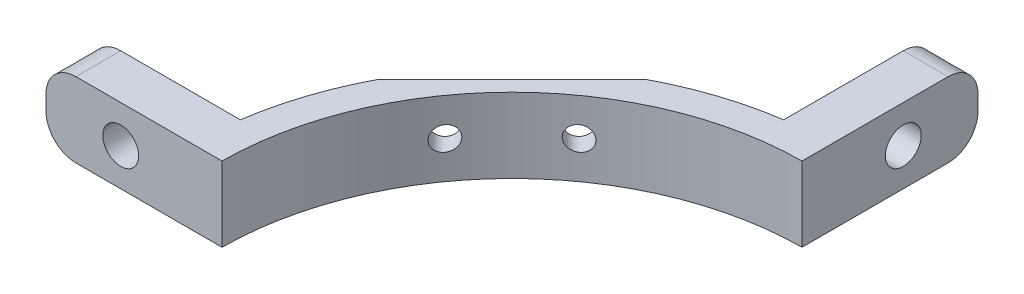
ISO-10303-21;
HEADER;
FILE_DESCRIPTION(('STEP AP214'),'2;1');
FILE_NAME('part.step','',(''),(''),'','','');
FILE_SCHEMA(('AUTOMOTIVE_DESIGN { 1 0 10303 214 1 1 1 1 }'));
ENDSEC;
DATA;
#1=APPLICATION_CONTEXT('core data for automotive mechanical design processes');
#2=APPLICATION_PROTOCOL_DEFINITION('international standard','automotive_design',2000,#1);
#3=PRODUCT_CONTEXT('',#1,'mechanical');
#4=PRODUCT('Part','Part','',(#3));
#5=PRODUCT_RELATED_PRODUCT_CATEGORY('part','',(#4));
#6=PRODUCT_DEFINITION_FORMATION('','',#4);
#7=PRODUCT_DEFINITION_CONTEXT('part definition',#1,'design');
#8=PRODUCT_DEFINITION('design','',#6,#7);
#9=PRODUCT_DEFINITION_SHAPE('','',#8);
#10=(LENGTH_UNIT() NAMED_UNIT(*) SI_UNIT(.MILLI.,.METRE.));
#11=(NAMED_UNIT(*) PLANE_ANGLE_UNIT() SI_UNIT($,.RADIAN.));
#12=(NAMED_UNIT(*) SI_UNIT($,.STERADIAN.) SOLID_ANGLE_UNIT());
#13=UNCERTAINTY_MEASURE_WITH_UNIT(LENGTH_MEASURE(1.E-05),#10,'distance_accuracy_value','');
#14=(GEOMETRIC_REPRESENTATION_CONTEXT(3) GLOBAL_UNCERTAINTY_ASSIGNED_CONTEXT((#13)) GLOBAL_UNIT_ASSIGNED_CONTEXT((#10,
#11,#12)) REPRESENTATION_CONTEXT('',''));
#15=CARTESIAN_POINT('',(0.,0.,0.));
#16=DIRECTION('',(0.,0.,1.));
#17=DIRECTION('',(1.,0.,0.));
#18=AXIS2_PLACEMENT_3D('',#15,#16,#17);
#19=CARTESIAN_POINT('',(0.,2.5,0.));
#20=DIRECTION('',(0.,-1.,0.));
#21=DIRECTION('',(0.,0.,-1.));
#22=AXIS2_PLACEMENT_3D('',#19,#20,#21);
#23=CYLINDRICAL_SURFACE('',#22,21.5);
#24=CARTESIAN_POINT('',(0.,-2.5,0.));
#25=DIRECTION('',(0.,1.,0.));
#26=DIRECTION('',(0.,0.,1.));
#27=AXIS2_PLACEMENT_3D('',#24,#25,#26);
#28=CIRCLE('',#27,21.5);
#29=CARTESIAN_POINT('',(-3.1,-2.5,-21.2753378351555));
#30=VERTEX_POINT('',#29);
#31=CARTESIAN_POINT('',(-10.0344631557441,-2.5,-19.0147192768133));
#32=VERTEX_POINT('',#31);
#33=EDGE_CURVE('E158',#30,#32,#28,.T.);
#34=ORIENTED_EDGE('',*,*,#33,.T.);
#35=DIRECTION('',(0.,-1.,0.));
#36=VECTOR('',#35,1.);
#37=CARTESIAN_POINT('',(-10.0344631557441,2.5,-19.0147192768133));
#38=LINE('',#37,#36);
#39=CARTESIAN_POINT('',(-10.0344631557441,2.5,-19.0147192768133));
#40=VERTEX_POINT('',#39);
#41=EDGE_CURVE('E59',#40,#32,#38,.T.);
#42=ORIENTED_EDGE('',*,*,#41,.F.);
#43=CARTESIAN_POINT('',(0.,2.5,0.));
#44=DIRECTION('',(0.,1.,0.));
#45=DIRECTION('',(0.,0.,1.));
#46=AXIS2_PLACEMENT_3D('',#43,#44,#45);
#47=CIRCLE('',#46,21.5);
#48=CARTESIAN_POINT('',(-3.1,2.5,-21.2753378351555));
#49=VERTEX_POINT('',#48);
#50=EDGE_CURVE('E156',#49,#40,#47,.T.);
#51=ORIENTED_EDGE('',*,*,#50,.F.);
#52=DIRECTION('',(0.,-1.,0.));
#53=VECTOR('',#52,1.);
#54=CARTESIAN_POINT('',(-3.1,2.5,-21.2753378351555));
#55=LINE('',#54,#53);
#56=EDGE_CURVE('E211',#49,#30,#55,.T.);
#57=ORIENTED_EDGE('',*,*,#56,.T.);
#58=EDGE_LOOP('',(#34,#42,#51,#57));
#59=FACE_BOUND('',#58,.T.);
#60=ADVANCED_FACE('F37',(#59),#23,.T.);
#61=CARTESIAN_POINT('',(-0.100000000000004,2.5,-31.2753378351555));
#62=DIRECTION('',(0.,0.,1.));
#63=DIRECTION('',(1.,0.,0.));
#64=AXIS2_PLACEMENT_3D('',#61,#62,#63);
#65=PLANE('',#64);
#66=DIRECTION('',(0.,-1.,0.));
#67=VECTOR('',#66,1.);
#68=CARTESIAN_POINT('',(-3.1,2.5,-31.2753378351555));
#69=LINE('',#68,#67);
#70=CARTESIAN_POINT('',(-3.1,0.5,-31.2753378351555));
#71=VERTEX_POINT('',#70);
#72=CARTESIAN_POINT('',(-3.1,-0.5,-31.2753378351555));
#73=VERTEX_POINT('',#72);
#74=EDGE_CURVE('E213',#71,#73,#69,.T.);
#75=ORIENTED_EDGE('',*,*,#74,.F.);
#76=DIRECTION('',(-1.,0.,0.));
#77=VECTOR('',#76,1.);
#78=CARTESIAN_POINT('',(-0.100000000000004,0.5,-31.2753378351555));
#79=LINE('',#78,#77);
#80=CARTESIAN_POINT('',(-0.100000000000004,0.5,-31.2753378351555));
#81=VERTEX_POINT('',#80);
#82=EDGE_CURVE('E245',#71,#81,#79,.F.);
#83=ORIENTED_EDGE('',*,*,#82,.T.);
#84=DIRECTION('',(0.,-1.,0.));
#85=VECTOR('',#84,1.);
#86=CARTESIAN_POINT('',(-0.100000000000004,2.5,-31.2753378351555));
#87=LINE('',#86,#85);
#88=CARTESIAN_POINT('',(-0.100000000000004,-0.5,-31.2753378351555));
#89=VERTEX_POINT('',#88);
#90=EDGE_CURVE('E180',#81,#89,#87,.T.);
#91=ORIENTED_EDGE('',*,*,#90,.T.);
#92=DIRECTION('',(-1.,0.,0.));
#93=VECTOR('',#92,1.);
#94=CARTESIAN_POINT('',(-0.100000000000004,-0.5,-31.2753378351555));
#95=LINE('',#94,#93);
#96=EDGE_CURVE('E242',#89,#73,#95,.T.);
#97=ORIENTED_EDGE('',*,*,#96,.T.);
#98=EDGE_LOOP('',(#75,#83,#91,#97));
#99=FACE_BOUND('',#98,.T.);
#100=ADVANCED_FACE('F292',(#99),#65,.F.);
#101=CARTESIAN_POINT('',(-3.1,2.5,-31.2753378351555));
#102=DIRECTION('',(1.,0.,0.));
#103=DIRECTION('',(0.,0.,-1.));
#104=AXIS2_PLACEMENT_3D('',#101,#102,#103);
#105=PLANE('',#104);
#106=CARTESIAN_POINT('',(-3.1,0.,-26.2753378351555));
#107=DIRECTION('',(1.,0.,0.));
#108=DIRECTION('',(0.,0.,-1.));
#109=AXIS2_PLACEMENT_3D('',#106,#107,#108);
#110=CIRCLE('',#109,1.2);
#111=CARTESIAN_POINT('',(-3.1,0.,-27.4753378351555));
#112=VERTEX_POINT('',#111);
#113=EDGE_CURVE('E184',#112,#112,#110,.T.);
#114=ORIENTED_EDGE('',*,*,#113,.T.);
#115=EDGE_LOOP('',(#114));
#116=FACE_BOUND('',#115,.T.);
#117=DIRECTION('',(0.,0.,1.));
#118=VECTOR('',#117,1.);
#119=CARTESIAN_POINT('',(-3.1,2.5,-31.2753378351555));
#120=LINE('',#119,#118);
#121=CARTESIAN_POINT('',(-3.1,2.5,-29.2753378351555));
#122=VERTEX_POINT('',#121);
#123=EDGE_CURVE('E163',#122,#49,#120,.T.);
#124=ORIENTED_EDGE('',*,*,#123,.F.);
#125=CARTESIAN_POINT('',(-3.1,0.5,-29.2753378351555));
#126=DIRECTION('',(1.,0.,0.));
#127=DIRECTION('',(0.,0.,-1.));
#128=AXIS2_PLACEMENT_3D('',#125,#126,#127);
#129=CIRCLE('',#128,2.);
#130=EDGE_CURVE('E240',#122,#71,#129,.F.);
#131=ORIENTED_EDGE('',*,*,#130,.T.);
#132=ORIENTED_EDGE('',*,*,#74,.T.);
#133=CARTESIAN_POINT('',(-3.1,-0.5,-29.2753378351555));
#134=DIRECTION('',(1.,0.,0.));
#135=DIRECTION('',(0.,0.,-1.));
#136=AXIS2_PLACEMENT_3D('',#133,#134,#135);
#137=CIRCLE('',#136,2.);
#138=CARTESIAN_POINT('',(-3.1,-2.5,-29.2753378351555));
#139=VERTEX_POINT('',#138);
#140=EDGE_CURVE('E238',#73,#139,#137,.F.);
#141=ORIENTED_EDGE('',*,*,#140,.T.);
#142=DIRECTION('',(0.,0.,1.));
#143=VECTOR('',#142,1.);
#144=CARTESIAN_POINT('',(-3.1,-2.5,-31.2753378351555));
#145=LINE('',#144,#143);
#146=EDGE_CURVE('E181',#139,#30,#145,.T.);
#147=ORIENTED_EDGE('',*,*,#146,.T.);
#148=ORIENTED_EDGE('',*,*,#56,.F.);
#149=EDGE_LOOP('',(#124,#131,#132,#141,#147,#148));
#150=FACE_BOUND('',#149,.T.);
#151=ADVANCED_FACE('F298',(#116,#150),#105,.F.);
#152=CARTESIAN_POINT('',(-19.0147192768133,2.5,-10.0344631557441));
#153=VERTEX_POINT('',#152);
#154=CARTESIAN_POINT('',(-21.2753378351555,2.5,-3.10000000000001));
#155=VERTEX_POINT('',#154);
#156=EDGE_CURVE('E166',#153,#155,#47,.T.);
#157=ORIENTED_EDGE('',*,*,#156,.F.);
#158=DIRECTION('',(0.,-1.,0.));
#159=VECTOR('',#158,1.);
#160=CARTESIAN_POINT('',(-19.0147192768133,2.5,-10.0344631557441));
#161=LINE('',#160,#159);
#162=CARTESIAN_POINT('',(-19.0147192768133,-2.5,-10.0344631557441));
#163=VERTEX_POINT('',#162);
#164=EDGE_CURVE('E146',#153,#163,#161,.T.);
#165=ORIENTED_EDGE('',*,*,#164,.T.);
#166=CARTESIAN_POINT('',(-21.2753378351555,-2.5,-3.10000000000001));
#167=VERTEX_POINT('',#166);
#168=EDGE_CURVE('E183',#163,#167,#28,.T.);
#169=ORIENTED_EDGE('',*,*,#168,.T.);
#170=DIRECTION('',(0.,-1.,0.));
#171=VECTOR('',#170,1.);
#172=CARTESIAN_POINT('',(-21.2753378351555,2.5,-3.10000000000001));
#173=LINE('',#172,#171);
#174=EDGE_CURVE('E208',#155,#167,#173,.T.);
#175=ORIENTED_EDGE('',*,*,#174,.F.);
#176=EDGE_LOOP('',(#157,#165,#169,#175));
#177=FACE_BOUND('',#176,.T.);
#178=ADVANCED_FACE('F294',(#177),#23,.T.);
#179=CARTESIAN_POINT('',(-21.2753378351555,2.5,-3.1));
#180=DIRECTION('',(0.,0.,1.));
#181=DIRECTION('',(1.,0.,0.));
#182=AXIS2_PLACEMENT_3D('',#179,#180,#181);
#183=PLANE('',#182);
#184=CARTESIAN_POINT('',(-26.2753378351555,0.,-3.10000000000001));
#185=DIRECTION('',(0.,0.,-1.));
#186=DIRECTION('',(-1.,0.,0.));
#187=AXIS2_PLACEMENT_3D('',#184,#185,#186);
#188=CIRCLE('',#187,1.2);
#189=CARTESIAN_POINT('',(-27.4753378351555,0.,-3.10000000000001));
#190=VERTEX_POINT('',#189);
#191=EDGE_CURVE('E354',#190,#190,#188,.T.);
#192=ORIENTED_EDGE('',*,*,#191,.F.);
#193=EDGE_LOOP('',(#192));
#194=FACE_BOUND('',#193,.T.);
#195=DIRECTION('',(0.,-1.,0.));
#196=VECTOR('',#195,1.);
#197=CARTESIAN_POINT('',(-31.2753378351555,2.5,-3.1));
#198=LINE('',#197,#196);
#199=CARTESIAN_POINT('',(-31.2753378351555,0.5,-3.1));
#200=VERTEX_POINT('',#199);
#201=CARTESIAN_POINT('',(-31.2753378351555,-0.5,-3.1));
#202=VERTEX_POINT('',#201);
#203=EDGE_CURVE('E205',#200,#202,#198,.T.);
#204=ORIENTED_EDGE('',*,*,#203,.F.);
#205=CARTESIAN_POINT('',(-29.2753378351555,0.5,-3.1));
#206=DIRECTION('',(0.,0.,1.));
#207=DIRECTION('',(1.,0.,0.));
#208=AXIS2_PLACEMENT_3D('',#205,#206,#207);
#209=CIRCLE('',#208,2.);
#210=CARTESIAN_POINT('',(-29.2753378351555,2.5,-3.1));
#211=VERTEX_POINT('',#210);
#212=EDGE_CURVE('E232',#200,#211,#209,.F.);
#213=ORIENTED_EDGE('',*,*,#212,.T.);
#214=DIRECTION('',(-1.,0.,0.));
#215=VECTOR('',#214,1.);
#216=CARTESIAN_POINT('',(-21.2753378351555,2.5,-3.1));
#217=LINE('',#216,#215);
#218=EDGE_CURVE('E165',#155,#211,#217,.T.);
#219=ORIENTED_EDGE('',*,*,#218,.F.);
#220=ORIENTED_EDGE('',*,*,#174,.T.);
#221=DIRECTION('',(-1.,0.,0.));
#222=VECTOR('',#221,1.);
#223=CARTESIAN_POINT('',(-21.2753378351555,-2.5,-3.1));
#224=LINE('',#223,#222);
#225=CARTESIAN_POINT('',(-29.2753378351555,-2.5,-3.1));
#226=VERTEX_POINT('',#225);
#227=EDGE_CURVE('E186',#167,#226,#224,.T.);
#228=ORIENTED_EDGE('',*,*,#227,.T.);
#229=CARTESIAN_POINT('',(-29.2753378351555,-0.5,-3.1));
#230=DIRECTION('',(0.,0.,1.));
#231=DIRECTION('',(1.,0.,0.));
#232=AXIS2_PLACEMENT_3D('',#229,#230,#231);
#233=CIRCLE('',#232,2.);
#234=EDGE_CURVE('E230',#226,#202,#233,.F.);
#235=ORIENTED_EDGE('',*,*,#234,.T.);
#236=EDGE_LOOP('',(#204,#213,#219,#220,#228,#235));
#237=FACE_BOUND('',#236,.T.);
#238=ADVANCED_FACE('F304',(#194,#237),#183,.F.);
#239=CARTESIAN_POINT('',(-31.2753378351555,2.5,-3.1));
#240=DIRECTION('',(1.,0.,0.));
#241=DIRECTION('',(0.,0.,-1.));
#242=AXIS2_PLACEMENT_3D('',#239,#240,#241);
#243=PLANE('',#242);
#244=DIRECTION('',(0.,-1.,0.));
#245=VECTOR('',#244,1.);
#246=CARTESIAN_POINT('',(-31.2753378351555,2.5,-0.0999999999999998));
#247=LINE('',#246,#245);
#248=CARTESIAN_POINT('',(-31.2753378351555,0.5,-0.0999999999999998));
#249=VERTEX_POINT('',#248);
#250=CARTESIAN_POINT('',(-31.2753378351555,-0.5,-0.0999999999999998));
#251=VERTEX_POINT('',#250);
#252=EDGE_CURVE('E202',#249,#251,#247,.T.);
#253=ORIENTED_EDGE('',*,*,#252,.F.);
#254=DIRECTION('',(0.,0.,1.));
#255=VECTOR('',#254,1.);
#256=CARTESIAN_POINT('',(-31.2753378351555,0.5,-3.1));
#257=LINE('',#256,#255);
#258=EDGE_CURVE('E228',#249,#200,#257,.F.);
#259=ORIENTED_EDGE('',*,*,#258,.T.);
#260=ORIENTED_EDGE('',*,*,#203,.T.);
#261=DIRECTION('',(0.,0.,1.));
#262=VECTOR('',#261,1.);
#263=CARTESIAN_POINT('',(-31.2753378351555,-0.5,-3.1));
#264=LINE('',#263,#262);
#265=EDGE_CURVE('E225',#202,#251,#264,.T.);
#266=ORIENTED_EDGE('',*,*,#265,.T.);
#267=EDGE_LOOP('',(#253,#259,#260,#266));
#268=FACE_BOUND('',#267,.T.);
#269=ADVANCED_FACE('F310',(#268),#243,.F.);
#270=CARTESIAN_POINT('',(-31.2753378351555,2.5,-0.0999999999999998));
#271=DIRECTION('',(0.,0.,-1.));
#272=DIRECTION('',(-1.,0.,0.));
#273=AXIS2_PLACEMENT_3D('',#270,#271,#272);
#274=PLANE('',#273);
#275=CARTESIAN_POINT('',(-26.2753378351555,0.,-0.0999999999999959));
#276=DIRECTION('',(0.,0.,-1.));
#277=DIRECTION('',(-1.,0.,0.));
#278=AXIS2_PLACEMENT_3D('',#275,#276,#277);
#279=CIRCLE('',#278,1.2);
#280=CARTESIAN_POINT('',(-27.4753378351555,0.,-0.0999999999999959));
#281=VERTEX_POINT('',#280);
#282=EDGE_CURVE('E358',#281,#281,#279,.T.);
#283=ORIENTED_EDGE('',*,*,#282,.T.);
#284=EDGE_LOOP('',(#283));
#285=FACE_BOUND('',#284,.T.);
#286=DIRECTION('',(1.,0.,0.));
#287=VECTOR('',#286,1.);
#288=CARTESIAN_POINT('',(-31.2753378351555,2.5,-0.0999999999999998));
#289=LINE('',#288,#287);
#290=CARTESIAN_POINT('',(-29.2753378351555,2.5,-0.0999999999999998));
#291=VERTEX_POINT('',#290);
#292=CARTESIAN_POINT('',(-19.4997435880578,2.5,-0.0999999999999998));
#293=VERTEX_POINT('',#292);
#294=EDGE_CURVE('E169',#291,#293,#289,.T.);
#295=ORIENTED_EDGE('',*,*,#294,.F.);
#296=CARTESIAN_POINT('',(-29.2753378351555,0.5,-0.0999999999999998));
#297=DIRECTION('',(0.,0.,-1.));
#298=DIRECTION('',(-1.,0.,0.));
#299=AXIS2_PLACEMENT_3D('',#296,#297,#298);
#300=CIRCLE('',#299,2.);
#301=EDGE_CURVE('E223',#291,#249,#300,.F.);
#302=ORIENTED_EDGE('',*,*,#301,.T.);
#303=ORIENTED_EDGE('',*,*,#252,.T.);
#304=CARTESIAN_POINT('',(-29.2753378351555,-0.5,-0.0999999999999998));
#305=DIRECTION('',(0.,0.,-1.));
#306=DIRECTION('',(-1.,0.,0.));
#307=AXIS2_PLACEMENT_3D('',#304,#305,#306);
#308=CIRCLE('',#307,2.);
#309=CARTESIAN_POINT('',(-29.2753378351555,-2.5,-0.0999999999999998));
#310=VERTEX_POINT('',#309);
#311=EDGE_CURVE('E221',#251,#310,#308,.F.);
#312=ORIENTED_EDGE('',*,*,#311,.T.);
#313=DIRECTION('',(1.,0.,0.));
#314=VECTOR('',#313,1.);
#315=CARTESIAN_POINT('',(-31.2753378351555,-2.5,-0.0999999999999998));
#316=LINE('',#315,#314);
#317=CARTESIAN_POINT('',(-19.4997435880578,-2.5,-0.0999999999999998));
#318=VERTEX_POINT('',#317);
#319=EDGE_CURVE('E189',#310,#318,#316,.T.);
#320=ORIENTED_EDGE('',*,*,#319,.T.);
#321=DIRECTION('',(0.,-1.,0.));
#322=VECTOR('',#321,1.);
#323=CARTESIAN_POINT('',(-19.4997435880578,2.5,-0.0999999999999998));
#324=LINE('',#323,#322);
#325=EDGE_CURVE('E199',#293,#318,#324,.T.);
#326=ORIENTED_EDGE('',*,*,#325,.F.);
#327=EDGE_LOOP('',(#295,#302,#303,#312,#320,#326));
#328=FACE_BOUND('',#327,.T.);
#329=ADVANCED_FACE('F288',(#285,#328),#274,.F.);
#330=CARTESIAN_POINT('',(0.,2.5,0.));
#331=DIRECTION('',(0.,-1.,0.));
#332=DIRECTION('',(0.,0.,-1.));
#333=AXIS2_PLACEMENT_3D('',#330,#331,#332);
#334=CYLINDRICAL_SURFACE('',#333,19.5);
#335=CARTESIAN_POINT('',(-16.3098119226622,0.,-10.6883130122291));
#336=CARTESIAN_POINT('',(-16.3098108613255,0.0442766566547629,-10.6883148818435));
#337=CARTESIAN_POINT('',(-16.3077471174383,0.088585420366677,-10.6914658563349));
#338=CARTESIAN_POINT('',(-16.2995419883405,0.175967539713107,-10.7039705073038));
#339=CARTESIAN_POINT('',(-16.2933957227045,0.219039352272558,-10.7133316076212));
#340=CARTESIAN_POINT('',(-16.2771983915752,0.302654875974712,-10.7379247435954));
#341=CARTESIAN_POINT('',(-16.2671511458306,0.343201015268183,-10.7531510360781));
#342=CARTESIAN_POINT('',(-16.2434214620619,0.420687142770971,-10.7889628042123));
#343=CARTESIAN_POINT('',(-16.2297397221619,0.457627821666107,-10.809547250639));
#344=CARTESIAN_POINT('',(-16.1989332545422,0.527298808492149,-10.8556591643588));
#345=CARTESIAN_POINT('',(-16.1817743611351,0.559981587596281,-10.8812355816938));
#346=CARTESIAN_POINT('',(-16.1445407966535,0.619834195778156,-10.9364028863057));
#347=CARTESIAN_POINT('',(-16.1244657513103,0.647003316139815,-10.9659942888472));
#348=CARTESIAN_POINT('',(-16.0814985980854,0.695592233687669,-11.0289110472572));
#349=CARTESIAN_POINT('',(-16.0585603758356,0.716893522326709,-11.0622964590014));
#350=CARTESIAN_POINT('',(-16.0107699672671,0.752496399829484,-11.1313524375868));
#351=CARTESIAN_POINT('',(-15.9859176312423,0.766797440547707,-11.1670231831309));
#352=CARTESIAN_POINT('',(-15.934627581156,0.788150435552783,-11.2400916157899));
#353=CARTESIAN_POINT('',(-15.9081738993843,0.795109275866149,-11.2775053452646));
#354=CARTESIAN_POINT('',(-15.8546965913895,0.801250669093889,-11.3525644333803));
#355=CARTESIAN_POINT('',(-15.8276729572506,0.80043311393421,-11.390209795233));
#356=CARTESIAN_POINT('',(-15.7738051490066,0.791011714503424,-11.4646929939172));
#357=CARTESIAN_POINT('',(-15.7469611316152,0.78240178710671,-11.5015301768275));
#358=CARTESIAN_POINT('',(-15.6942752667183,0.757592573470195,-11.5733187662158));
#359=CARTESIAN_POINT('',(-15.6684333815835,0.741393572493179,-11.6082702435199));
#360=CARTESIAN_POINT('',(-15.6187640481157,0.701997708208394,-11.6750129673798));
#361=CARTESIAN_POINT('',(-15.5949216385905,0.678860142198299,-11.7068280712178));
#362=CARTESIAN_POINT('',(-15.5497743412959,0.626170587247305,-11.7667296549008));
#363=CARTESIAN_POINT('',(-15.5284693050198,0.5966189739919,-11.7948163529719));
#364=CARTESIAN_POINT('',(-15.4893152181169,0.532289418242995,-11.8461870805178));
#365=CARTESIAN_POINT('',(-15.471430848631,0.497572306991995,-11.8695203740536));
#366=CARTESIAN_POINT('',(-15.4394242964325,0.423658713514864,-11.9111237341934));
#367=CARTESIAN_POINT('',(-15.4253019295617,0.384462450687079,-11.929394048643));
#368=CARTESIAN_POINT('',(-15.4014017424533,0.303073984244237,-11.9602342597484));
#369=CARTESIAN_POINT('',(-15.391587057097,0.260910934607533,-11.9728525463896));
#370=CARTESIAN_POINT('',(-15.3764540305728,0.174491860199304,-11.9922814534555));
#371=CARTESIAN_POINT('',(-15.3711355513651,0.130235899727206,-11.9990922521786));
#372=CARTESIAN_POINT('',(-15.3651899719612,0.0411196987698526,-12.0067048252051));
#373=CARTESIAN_POINT('',(-15.3645400352332,-0.00373652342083588,-12.0075358500639));
#374=CARTESIAN_POINT('',(-15.3678929317873,-0.0929874811051633,-12.0032443107483));
#375=CARTESIAN_POINT('',(-15.3718957024604,-0.137382222800588,-11.9981218266871));
#376=CARTESIAN_POINT('',(-15.3844112914609,-0.224394293038598,-11.9820695841141));
#377=CARTESIAN_POINT('',(-15.392918546236,-0.267013744376021,-11.9711469893534));
#378=CARTESIAN_POINT('',(-15.4141554607689,-0.349330462534626,-11.943789580282));
#379=CARTESIAN_POINT('',(-15.4268851300186,-0.389027722786487,-11.9273547535797));
#380=CARTESIAN_POINT('',(-15.456179449296,-0.464473571406593,-11.8893688284497));
#381=CARTESIAN_POINT('',(-15.4727525407887,-0.5002132084012,-11.8678064655165));
#382=CARTESIAN_POINT('',(-15.509178602161,-0.566653190850203,-11.8201639552522));
#383=CARTESIAN_POINT('',(-15.5290316449782,-0.597353424211081,-11.7940837074545));
#384=CARTESIAN_POINT('',(-15.5715130913387,-0.653047616748495,-11.7379395187535));
#385=CARTESIAN_POINT('',(-15.5941572609684,-0.678006643025147,-11.7078528625057));
#386=CARTESIAN_POINT('',(-15.6414215267184,-0.721320319398114,-11.6446334676211));
#387=CARTESIAN_POINT('',(-15.6660417105772,-0.739674676036993,-11.6115005937176));
#388=CARTESIAN_POINT('',(-15.71675997408,-0.769451840324868,-11.5427594582072));
#389=CARTESIAN_POINT('',(-15.7428698880749,-0.780807024156938,-11.5071306408471));
#390=CARTESIAN_POINT('',(-15.7955855600538,-0.796034206177208,-11.4346615286073));
#391=CARTESIAN_POINT('',(-15.8221913503616,-0.799905714805806,-11.3978211546315));
#392=CARTESIAN_POINT('',(-15.875438200183,-0.800091872585115,-11.3235406247488));
#393=CARTESIAN_POINT('',(-15.9020765241154,-0.796324269488609,-11.2860982930659));
#394=CARTESIAN_POINT('',(-15.9543614365413,-0.781189934575164,-11.2120651977394));
#395=CARTESIAN_POINT('',(-15.9800079693952,-0.769822777074847,-11.1754744819171));
#396=CARTESIAN_POINT('',(-16.029791778809,-0.739700371678091,-11.1039492131071));
#397=CARTESIAN_POINT('',(-16.0539176303654,-0.720895503193451,-11.0690275863537));
#398=CARTESIAN_POINT('',(-16.099824815005,-0.676407932644125,-11.0021492458298));
#399=CARTESIAN_POINT('',(-16.1216062299877,-0.65072547094785,-10.9701924284931));
#400=CARTESIAN_POINT('',(-16.1621728834785,-0.593278517594599,-10.9103378702116));
#401=CARTESIAN_POINT('',(-16.1809686035991,-0.561536204796197,-10.8824259608726));
#402=CARTESIAN_POINT('',(-16.2151568451138,-0.492767475398501,-10.8314188371443));
#403=CARTESIAN_POINT('',(-16.2305487837812,-0.455740155789708,-10.8083244475515));
#404=CARTESIAN_POINT('',(-16.257302215772,-0.378032283461298,-10.7680408046594));
#405=CARTESIAN_POINT('',(-16.2687192205104,-0.337412891764664,-10.7507703353336));
#406=CARTESIAN_POINT('',(-16.2875035172606,-0.253260114223724,-10.7222909523002));
#407=CARTESIAN_POINT('',(-16.2948762879379,-0.209730760650728,-10.7110738385347));
#408=CARTESIAN_POINT('',(-16.3033460794775,-0.138245718232754,-10.6981745291259));
#409=CARTESIAN_POINT('',(-16.3057677542388,-0.11078720164123,-10.6944820695314));
#410=CARTESIAN_POINT('',(-16.3090009989268,-0.0555566685617373,-10.6895507395728));
#411=CARTESIAN_POINT('',(-16.3098125886762,-0.0277846559376384,-10.6883118390016));
#412=CARTESIAN_POINT('',(-16.3098119226622,0.,-10.6883130122291));
#413=B_SPLINE_CURVE_WITH_KNOTS('',3,(#335,#336,#337,#338,#339,#340,#341,#342,#343,#344,#345,
#346,#347,#348,#349,#350,#351,#352,#353,#354,#355,#356,#357,#358,#359,#360,#361,#362,#363,#364,
#365,#366,#367,#368,#369,#370,#371,#372,#373,#374,#375,#376,#377,#378,#379,#380,#381,#382,#383,
#384,#385,#386,#387,#388,#389,#390,#391,#392,#393,#394,#395,#396,#397,#398,#399,#400,#401,#402,
#403,#404,#405,#406,#407,#408,#409,#410,#411,#412),.UNSPECIFIED.,.T.,.F.,(4,2,2,2,2,2,2,2,2,2,2,
2,2,2,2,2,2,2,2,2,2,2,2,2,2,2,2,2,2,2,2,2,2,2,2,2,2,2,4),(0.,0.132727328477592,
0.265613611272536,0.398370101742533,0.531101110379435,0.665205733133339,0.799327582558847,
0.935987130580682,1.07265737784353,1.21104077958715,1.34942610454536,1.4879195534595,
1.62640779701399,1.76374469974946,1.90107356051653,2.03689727623308,2.17271434186523,
2.30734527598671,2.44197207659464,2.57593988865098,2.70990589799498,2.84370682866894,
2.97750806012901,3.11160599550034,3.24570691326289,3.3806033835536,3.51550584679897,
3.65169206285177,3.78788718749718,3.92555654553697,4.06323361566945,4.20184512345364,
4.34045178746771,4.4785605577669,4.6166929539877,4.75281062838523,4.88874344785004,
4.97203403113344,5.05532358897034),.UNSPECIFIED.);
#414=CARTESIAN_POINT('',(-16.3098119226622,0.,-10.6883130122291));
#415=VERTEX_POINT('',#414);
#416=EDGE_CURVE('E41',#415,#415,#413,.T.);
#417=ORIENTED_EDGE('',*,*,#416,.T.);
#418=EDGE_LOOP('',(#417));
#419=FACE_BOUND('',#418,.T.);
#420=CARTESIAN_POINT('',(-12.0065516699683,0.,-15.3653088806044));
#421=CARTESIAN_POINT('',(-12.0065501771392,0.0446647233782857,-15.3653102224133));
#422=CARTESIAN_POINT('',(-12.0035726969525,0.0893614930695405,-15.3676381111312));
#423=CARTESIAN_POINT('',(-11.9917312113998,0.177520240035658,-15.3768799426672));
#424=CARTESIAN_POINT('',(-11.9828602143982,0.220980686691125,-15.3837993324934));
#425=CARTESIAN_POINT('',(-11.9594700155401,0.30537394173808,-15.4019899729971));
#426=CARTESIAN_POINT('',(-11.944954128664,0.34630821731457,-15.4132586695006));
#427=CARTESIAN_POINT('',(-11.9106654941467,0.424509428411089,-15.4397705563826));
#428=CARTESIAN_POINT('',(-11.8908940089831,0.461777241731445,-15.4550127922373));
#429=CARTESIAN_POINT('',(-11.8465629377477,0.531715766780944,-15.4890195515761));
#430=CARTESIAN_POINT('',(-11.8219908117745,0.564374044429143,-15.5077932949405));
#431=CARTESIAN_POINT('',(-11.7687530778836,0.624082154775189,-15.548233539385));
#432=CARTESIAN_POINT('',(-11.7400872010669,0.651131618770288,-15.5699002304829));
#433=CARTESIAN_POINT('',(-11.6792173495917,0.699069594825265,-15.6156120212685));
#434=CARTESIAN_POINT('',(-11.6469895549065,0.71991269815305,-15.6396730110521));
#435=CARTESIAN_POINT('',(-11.5800432007498,0.754633408036532,-15.6893063749399));
#436=CARTESIAN_POINT('',(-11.545324513725,0.768510657594387,-15.7148788264311));
#437=CARTESIAN_POINT('',(-11.4739716511048,0.789062620531508,-15.7670525668985));
#438=CARTESIAN_POINT('',(-11.437321385725,0.795661403496948,-15.7936617581237));
#439=CARTESIAN_POINT('',(-11.3634537283847,0.801252202829975,-15.846892190817));
#440=CARTESIAN_POINT('',(-11.3262363010327,0.800243742542051,-15.8735134329357));
#441=CARTESIAN_POINT('',(-11.2518871091413,0.790622138353076,-15.9263032881097));
#442=CARTESIAN_POINT('',(-11.2147601196009,0.781931270451286,-15.9524644803572));
#443=CARTESIAN_POINT('',(-11.1420413441784,0.757086680294728,-16.0033398172888));
#444=CARTESIAN_POINT('',(-11.1064496265671,0.740932626539244,-16.02805389764));
#445=CARTESIAN_POINT('',(-11.0377021137563,0.701517163286647,-16.0754746271706));
#446=CARTESIAN_POINT('',(-11.004556773968,0.678227218261884,-16.0981727359116));
#447=CARTESIAN_POINT('',(-10.9418727624178,0.625188659100008,-16.1408444731344));
#448=CARTESIAN_POINT('',(-10.9123340061701,0.595440196301774,-16.1608181654381));
#449=CARTESIAN_POINT('',(-10.8580078699683,0.530539462078785,-16.1973680417217));
#450=CARTESIAN_POINT('',(-10.8331866704547,0.495429183267681,-16.2139684726115));
#451=CARTESIAN_POINT('',(-10.788846402631,0.420618164889568,-16.2435065645549));
#452=CARTESIAN_POINT('',(-10.7693267970814,0.380917891033561,-16.2564445967448));
#453=CARTESIAN_POINT('',(-10.7365582620704,0.29879706508421,-16.2781048526169));
#454=CARTESIAN_POINT('',(-10.7232051750689,0.256436569518872,-16.2868971591114));
#455=CARTESIAN_POINT('',(-10.7027396858509,0.169605422371088,-16.3003532130961));
#456=CARTESIAN_POINT('',(-10.6956265613605,0.125135015638568,-16.3050174384112));
#457=CARTESIAN_POINT('',(-10.6879641286779,0.0361823541901756,-16.310041187967));
#458=CARTESIAN_POINT('',(-10.6873020430263,-0.00828605199430834,-16.3104746744711));
#459=CARTESIAN_POINT('',(-10.692270604629,-0.0967156657901559,-16.3072179693716));
#460=CARTESIAN_POINT('',(-10.6979009505172,-0.140676897589958,-16.3035279752557));
#461=CARTESIAN_POINT('',(-10.7152080564674,-0.226598034577931,-16.2921582834144));
#462=CARTESIAN_POINT('',(-10.7268512417414,-0.268567654278192,-16.2845007391184));
#463=CARTESIAN_POINT('',(-10.7557707518041,-0.34960624964467,-16.2654140424147));
#464=CARTESIAN_POINT('',(-10.7730473067604,-0.388675106711733,-16.2539847359005));
#465=CARTESIAN_POINT('',(-10.8128742211631,-0.463243865079091,-16.227517566255));
#466=CARTESIAN_POINT('',(-10.8354763066832,-0.498703537033635,-16.2124442696397));
#467=CARTESIAN_POINT('',(-10.8851437234167,-0.56466599014113,-16.1791389813979));
#468=CARTESIAN_POINT('',(-10.9122094806073,-0.59516829765074,-16.1609066882936));
#469=CARTESIAN_POINT('',(-10.9705333146022,-0.650954495785872,-16.1213727865562));
#470=CARTESIAN_POINT('',(-11.0018602373835,-0.676130307127852,-16.1000202217674));
#471=CARTESIAN_POINT('',(-11.0673736194284,-0.719878180722793,-16.0550558467719));
#472=CARTESIAN_POINT('',(-11.1015603341647,-0.738449652213081,-16.0314438346957));
#473=CARTESIAN_POINT('',(-11.1723592428942,-0.768738138050605,-15.9821861851978));
#474=CARTESIAN_POINT('',(-11.209000757128,-0.780344779774769,-15.9565147578049));
#475=CARTESIAN_POINT('',(-11.2831702551152,-0.795927417853612,-15.9041544623485));
#476=CARTESIAN_POINT('',(-11.3206982730558,-0.799903119440506,-15.8774655550224));
#477=CARTESIAN_POINT('',(-11.3957441069753,-0.800093789196581,-15.8236897178303));
#478=CARTESIAN_POINT('',(-11.4332611341923,-0.796274138509961,-15.796601545171));
#479=CARTESIAN_POINT('',(-11.507047536436,-0.780877714736701,-15.7429329805055));
#480=CARTESIAN_POINT('',(-11.5433169406303,-0.769301123124972,-15.716352576635));
#481=CARTESIAN_POINT('',(-11.6133594705304,-0.738776213721569,-15.6646661709985));
#482=CARTESIAN_POINT('',(-11.6471465317787,-0.719873505879646,-15.6395521320578));
#483=CARTESIAN_POINT('',(-11.7115116190944,-0.675197348934264,-15.5914115000743));
#484=CARTESIAN_POINT('',(-11.7420899483966,-0.649424549891564,-15.5683847098082));
#485=CARTESIAN_POINT('',(-11.7988615825841,-0.592040568123992,-15.5254024688034));
#486=CARTESIAN_POINT('',(-11.8250991096137,-0.560496186368173,-15.5054162359313));
#487=CARTESIAN_POINT('',(-11.8728679726367,-0.492261138285502,-15.4688691661559));
#488=CARTESIAN_POINT('',(-11.8943983943035,-0.455569474398517,-15.4523089947777));
#489=CARTESIAN_POINT('',(-11.9319730117634,-0.378462134526335,-15.4233128715479));
#490=CARTESIAN_POINT('',(-11.9480661513989,-0.338084078359022,-15.4108401587435));
#491=CARTESIAN_POINT('',(-11.9745886029674,-0.25449971616817,-15.390240820896));
#492=CARTESIAN_POINT('',(-11.985024902671,-0.211296973724334,-15.382108834039));
#493=CARTESIAN_POINT('',(-11.997169676602,-0.139845057268907,-15.3726364745406));
#494=CARTESIAN_POINT('',(-12.0006837081197,-0.112068101859974,-15.369892632354));
#495=CARTESIAN_POINT('',(-12.0053751706161,-0.0561983266439976,-15.3662284162375));
#496=CARTESIAN_POINT('',(-12.0065526093387,-0.0281055078840931,-15.3653080362643));
#497=CARTESIAN_POINT('',(-12.0065516699683,0.,-15.3653088806044));
#498=B_SPLINE_CURVE_WITH_KNOTS('',3,(#420,#421,#422,#423,#424,#425,#426,#427,#428,#429,#430,
#431,#432,#433,#434,#435,#436,#437,#438,#439,#440,#441,#442,#443,#444,#445,#446,#447,#448,#449,
#450,#451,#452,#453,#454,#455,#456,#457,#458,#459,#460,#461,#462,#463,#464,#465,#466,#467,#468,
#469,#470,#471,#472,#473,#474,#475,#476,#477,#478,#479,#480,#481,#482,#483,#484,#485,#486,#487,
#488,#489,#490,#491,#492,#493,#494,#495,#496,#497),.UNSPECIFIED.,.T.,.F.,(4,2,2,2,2,2,2,2,2,2,2,
2,2,2,2,2,2,2,2,2,2,2,2,2,2,2,2,2,2,2,2,2,2,2,2,2,2,2,4),(0.,0.133891329126736,
0.267941781406765,0.401913630699015,0.535853326874935,0.670147685242281,0.804450868829315,
0.939713809224429,1.07498368109564,1.21165174666959,1.34832837567783,1.48640381258912,
1.62448538314205,1.7631264948719,1.90176435825173,2.03936739873277,2.1769564899385,
2.3121279545812,2.44728377109819,2.58007245447696,2.71285477842491,2.84490355654981,
2.9769577305865,3.11035163305333,3.24375827294127,3.37965601946752,3.51556591908334,
3.65357632561854,3.79159206310937,3.93022205672699,4.06884880718632,4.20662602924538,
4.34439021919321,4.48065061591238,4.6169374569189,4.751962614684,4.88682059649297,
4.97107268613703,5.05532449655377),.UNSPECIFIED.);
#499=CARTESIAN_POINT('',(-12.0065516699683,0.,-15.3653088806044));
#500=VERTEX_POINT('',#499);
#501=EDGE_CURVE('E247',#500,#500,#498,.T.);
#502=ORIENTED_EDGE('',*,*,#501,.T.);
#503=EDGE_LOOP('',(#502));
#504=FACE_BOUND('',#503,.T.);
#505=CARTESIAN_POINT('',(0.,-2.5,0.));
#506=DIRECTION('',(0.,-1.,0.));
#507=DIRECTION('',(0.,0.,1.));
#508=AXIS2_PLACEMENT_3D('',#505,#506,#507);
#509=CIRCLE('',#508,19.5);
#510=CARTESIAN_POINT('',(-0.0999999999999965,-2.5,-19.4997435880578));
#511=VERTEX_POINT('',#510);
#512=EDGE_CURVE('E191',#318,#511,#509,.T.);
#513=ORIENTED_EDGE('',*,*,#512,.T.);
#514=DIRECTION('',(0.,-1.,0.));
#515=VECTOR('',#514,1.);
#516=CARTESIAN_POINT('',(-0.0999999999999965,2.5,-19.4997435880578));
#517=LINE('',#516,#515);
#518=CARTESIAN_POINT('',(-0.0999999999999965,2.5,-19.4997435880578));
#519=VERTEX_POINT('',#518);
#520=EDGE_CURVE('E196',#519,#511,#517,.T.);
#521=ORIENTED_EDGE('',*,*,#520,.F.);
#522=CARTESIAN_POINT('',(0.,2.5,0.));
#523=DIRECTION('',(0.,-1.,0.));
#524=DIRECTION('',(0.,0.,1.));
#525=AXIS2_PLACEMENT_3D('',#522,#523,#524);
#526=CIRCLE('',#525,19.5);
#527=EDGE_CURVE('E175',#293,#519,#526,.T.);
#528=ORIENTED_EDGE('',*,*,#527,.F.);
#529=ORIENTED_EDGE('',*,*,#325,.T.);
#530=EDGE_LOOP('',(#513,#521,#528,#529));
#531=FACE_BOUND('',#530,.T.);
#532=ADVANCED_FACE('F254',(#419,#504,#531),#334,.F.);
#533=CARTESIAN_POINT('',(-0.100000000000004,2.5,-31.2753378351555));
#534=DIRECTION('',(-1.,0.,0.));
#535=DIRECTION('',(0.,0.,1.));
#536=AXIS2_PLACEMENT_3D('',#533,#534,#535);
#537=PLANE('',#536);
#538=CARTESIAN_POINT('',(-0.1,0.,-26.2753378351555));
#539=DIRECTION('',(1.,0.,0.));
#540=DIRECTION('',(0.,0.,-1.));
#541=AXIS2_PLACEMENT_3D('',#538,#539,#540);
#542=CIRCLE('',#541,1.2);
#543=CARTESIAN_POINT('',(-0.1,0.,-27.4753378351555));
#544=VERTEX_POINT('',#543);
#545=EDGE_CURVE('E361',#544,#544,#542,.T.);
#546=ORIENTED_EDGE('',*,*,#545,.F.);
#547=EDGE_LOOP('',(#546));
#548=FACE_BOUND('',#547,.T.);
#549=ORIENTED_EDGE('',*,*,#90,.F.);
#550=CARTESIAN_POINT('',(-0.100000000000003,0.5,-29.2753378351555));
#551=DIRECTION('',(-1.,0.,0.));
#552=DIRECTION('',(0.,0.,1.));
#553=AXIS2_PLACEMENT_3D('',#550,#551,#552);
#554=CIRCLE('',#553,2.);
#555=CARTESIAN_POINT('',(-0.100000000000003,2.5,-29.2753378351555));
#556=VERTEX_POINT('',#555);
#557=EDGE_CURVE('E11',#81,#556,#554,.F.);
#558=ORIENTED_EDGE('',*,*,#557,.T.);
#559=DIRECTION('',(0.,0.,-1.));
#560=VECTOR('',#559,1.);
#561=CARTESIAN_POINT('',(-0.100000000000004,2.5,-31.2753378351555));
#562=LINE('',#561,#560);
#563=EDGE_CURVE('E177',#519,#556,#562,.T.);
#564=ORIENTED_EDGE('',*,*,#563,.F.);
#565=ORIENTED_EDGE('',*,*,#520,.T.);
#566=DIRECTION('',(0.,0.,-1.));
#567=VECTOR('',#566,1.);
#568=CARTESIAN_POINT('',(-0.100000000000004,-2.5,-31.2753378351555));
#569=LINE('',#568,#567);
#570=CARTESIAN_POINT('',(-0.100000000000003,-2.5,-29.2753378351555));
#571=VERTEX_POINT('',#570);
#572=EDGE_CURVE('E193',#511,#571,#569,.T.);
#573=ORIENTED_EDGE('',*,*,#572,.T.);
#574=CARTESIAN_POINT('',(-0.100000000000003,-0.5,-29.2753378351555));
#575=DIRECTION('',(-1.,0.,0.));
#576=DIRECTION('',(0.,0.,1.));
#577=AXIS2_PLACEMENT_3D('',#574,#575,#576);
#578=CIRCLE('',#577,2.);
#579=EDGE_CURVE('E51',#571,#89,#578,.F.);
#580=ORIENTED_EDGE('',*,*,#579,.T.);
#581=EDGE_LOOP('',(#549,#558,#564,#565,#573,#580));
#582=FACE_BOUND('',#581,.T.);
#583=ADVANCED_FACE('F280',(#548,#582),#537,.F.);
#584=CARTESIAN_POINT('',(0.,2.5,0.));
#585=DIRECTION('',(0.,1.,0.));
#586=DIRECTION('',(0.,0.,1.));
#587=AXIS2_PLACEMENT_3D('',#584,#585,#586);
#588=PLANE('',#587);
#589=DIRECTION('',(-0.707106781186548,0.,0.707106781186547));
#590=VECTOR('',#589,1.);
#591=CARTESIAN_POINT('',(-19.0147192768133,2.5,-10.0344631557441));
#592=LINE('',#591,#590);
#593=EDGE_CURVE('E143',#40,#153,#592,.T.);
#594=ORIENTED_EDGE('',*,*,#593,.T.);
#595=ORIENTED_EDGE('',*,*,#156,.T.);
#596=ORIENTED_EDGE('',*,*,#218,.T.);
#597=DIRECTION('',(0.,0.,1.));
#598=VECTOR('',#597,1.);
#599=CARTESIAN_POINT('',(-29.2753378351555,2.5,-0.0999999999999998));
#600=LINE('',#599,#598);
#601=EDGE_CURVE('E218',#211,#291,#600,.T.);
#602=ORIENTED_EDGE('',*,*,#601,.T.);
#603=ORIENTED_EDGE('',*,*,#294,.T.);
#604=ORIENTED_EDGE('',*,*,#527,.T.);
#605=ORIENTED_EDGE('',*,*,#563,.T.);
#606=DIRECTION('',(-1.,0.,0.));
#607=VECTOR('',#606,1.);
#608=CARTESIAN_POINT('',(-3.1,2.5,-29.2753378351555));
#609=LINE('',#608,#607);
#610=EDGE_CURVE('E216',#556,#122,#609,.T.);
#611=ORIENTED_EDGE('',*,*,#610,.T.);
#612=ORIENTED_EDGE('',*,*,#123,.T.);
#613=ORIENTED_EDGE('',*,*,#50,.T.);
#614=EDGE_LOOP('',(#594,#595,#596,#602,#603,#604,#605,#611,#612,#613));
#615=FACE_BOUND('',#614,.T.);
#616=ADVANCED_FACE('F160',(#615),#588,.T.);
#617=CARTESIAN_POINT('',(0.,-2.5,0.));
#618=DIRECTION('',(0.,1.,0.));
#619=DIRECTION('',(0.,0.,1.));
#620=AXIS2_PLACEMENT_3D('',#617,#618,#619);
#621=PLANE('',#620);
#622=ORIENTED_EDGE('',*,*,#168,.F.);
#623=DIRECTION('',(-0.707106781186548,0.,0.707106781186547));
#624=VECTOR('',#623,1.);
#625=CARTESIAN_POINT('',(-19.0147192768133,-2.5,-10.0344631557441));
#626=LINE('',#625,#624);
#627=EDGE_CURVE('E150',#32,#163,#626,.T.);
#628=ORIENTED_EDGE('',*,*,#627,.F.);
#629=ORIENTED_EDGE('',*,*,#33,.F.);
#630=ORIENTED_EDGE('',*,*,#146,.F.);
#631=DIRECTION('',(-1.,0.,0.));
#632=VECTOR('',#631,1.);
#633=CARTESIAN_POINT('',(0.,-2.5,-29.2753378351555));
#634=LINE('',#633,#632);
#635=EDGE_CURVE('E234',#139,#571,#634,.F.);
#636=ORIENTED_EDGE('',*,*,#635,.T.);
#637=ORIENTED_EDGE('',*,*,#572,.F.);
#638=ORIENTED_EDGE('',*,*,#512,.F.);
#639=ORIENTED_EDGE('',*,*,#319,.F.);
#640=DIRECTION('',(0.,0.,1.));
#641=VECTOR('',#640,1.);
#642=CARTESIAN_POINT('',(-29.2753378351555,-2.5,0.));
#643=LINE('',#642,#641);
#644=EDGE_CURVE('E236',#310,#226,#643,.F.);
#645=ORIENTED_EDGE('',*,*,#644,.T.);
#646=ORIENTED_EDGE('',*,*,#227,.F.);
#647=EDGE_LOOP('',(#622,#628,#629,#630,#636,#637,#638,#639,#645,#646));
#648=FACE_BOUND('',#647,.T.);
#649=ADVANCED_FACE('F276',(#648),#621,.F.);
#650=CARTESIAN_POINT('',(-0.1,0.,-26.2753378351555));
#651=DIRECTION('',(1.,0.,0.));
#652=DIRECTION('',(0.,0.,-1.));
#653=AXIS2_PLACEMENT_3D('',#650,#651,#652);
#654=CYLINDRICAL_SURFACE('',#653,1.2);
#655=ORIENTED_EDGE('',*,*,#545,.T.);
#656=EDGE_LOOP('',(#655));
#657=FACE_BOUND('',#656,.T.);
#658=ORIENTED_EDGE('',*,*,#113,.F.);
#659=EDGE_LOOP('',(#658));
#660=FACE_BOUND('',#659,.T.);
#661=ADVANCED_FACE('F272',(#657,#660),#654,.F.);
#662=CARTESIAN_POINT('',(-26.2753378351555,0.,-3.10000000000001));
#663=DIRECTION('',(0.,0.,-1.));
#664=DIRECTION('',(-1.,0.,0.));
#665=AXIS2_PLACEMENT_3D('',#662,#663,#664);
#666=CYLINDRICAL_SURFACE('',#665,1.2);
#667=ORIENTED_EDGE('',*,*,#282,.F.);
#668=EDGE_LOOP('',(#667));
#669=FACE_BOUND('',#668,.T.);
#670=ORIENTED_EDGE('',*,*,#191,.T.);
#671=EDGE_LOOP('',(#670));
#672=FACE_BOUND('',#671,.T.);
#673=ADVANCED_FACE('F268',(#669,#672),#666,.F.);
#674=CARTESIAN_POINT('',(-29.2753378351555,0.5,0.));
#675=DIRECTION('',(0.,0.,-1.));
#676=DIRECTION('',(-1.,0.,0.));
#677=AXIS2_PLACEMENT_3D('',#674,#675,#676);
#678=CYLINDRICAL_SURFACE('',#677,2.);
#679=ORIENTED_EDGE('',*,*,#212,.F.);
#680=ORIENTED_EDGE('',*,*,#258,.F.);
#681=ORIENTED_EDGE('',*,*,#301,.F.);
#682=ORIENTED_EDGE('',*,*,#601,.F.);
#683=EDGE_LOOP('',(#679,#680,#681,#682));
#684=FACE_BOUND('',#683,.T.);
#685=ADVANCED_FACE('F271',(#684),#678,.T.);
#686=CARTESIAN_POINT('',(-29.2753378351555,-0.5,-3.1));
#687=DIRECTION('',(0.,0.,1.));
#688=DIRECTION('',(1.,0.,0.));
#689=AXIS2_PLACEMENT_3D('',#686,#687,#688);
#690=CYLINDRICAL_SURFACE('',#689,2.);
#691=ORIENTED_EDGE('',*,*,#234,.F.);
#692=ORIENTED_EDGE('',*,*,#644,.F.);
#693=ORIENTED_EDGE('',*,*,#311,.F.);
#694=ORIENTED_EDGE('',*,*,#265,.F.);
#695=EDGE_LOOP('',(#691,#692,#693,#694));
#696=FACE_BOUND('',#695,.T.);
#697=ADVANCED_FACE('F330',(#696),#690,.T.);
#698=CARTESIAN_POINT('',(0.,0.5,-29.2753378351555));
#699=DIRECTION('',(1.,0.,0.));
#700=DIRECTION('',(0.,0.,-1.));
#701=AXIS2_PLACEMENT_3D('',#698,#699,#700);
#702=CYLINDRICAL_SURFACE('',#701,2.);
#703=ORIENTED_EDGE('',*,*,#557,.F.);
#704=ORIENTED_EDGE('',*,*,#82,.F.);
#705=ORIENTED_EDGE('',*,*,#130,.F.);
#706=ORIENTED_EDGE('',*,*,#610,.F.);
#707=EDGE_LOOP('',(#703,#704,#705,#706));
#708=FACE_BOUND('',#707,.T.);
#709=ADVANCED_FACE('F343',(#708),#702,.T.);
#710=CARTESIAN_POINT('',(-0.100000000000004,-0.5,-29.2753378351555));
#711=DIRECTION('',(-1.,0.,0.));
#712=DIRECTION('',(0.,0.,1.));
#713=AXIS2_PLACEMENT_3D('',#710,#711,#712);
#714=CYLINDRICAL_SURFACE('',#713,2.);
#715=ORIENTED_EDGE('',*,*,#579,.F.);
#716=ORIENTED_EDGE('',*,*,#635,.F.);
#717=ORIENTED_EDGE('',*,*,#140,.F.);
#718=ORIENTED_EDGE('',*,*,#96,.F.);
#719=EDGE_LOOP('',(#715,#716,#717,#718));
#720=FACE_BOUND('',#719,.T.);
#721=ADVANCED_FACE('F39',(#720),#714,.T.);
#722=CARTESIAN_POINT('',(-19.0147192768133,2.5,-10.0344631557441));
#723=DIRECTION('',(0.707106781186547,0.,0.707106781186548));
#724=DIRECTION('',(0.707106781186548,0.,-0.707106781186547));
#725=AXIS2_PLACEMENT_3D('',#722,#723,#724);
#726=PLANE('',#725);
#727=CARTESIAN_POINT('',(-16.769655246546,0.,-12.2795271860114));
#728=DIRECTION('',(-0.707106781186547,0.,-0.707106781186548));
#729=DIRECTION('',(-0.707106781186548,0.,0.707106781186547));
#730=AXIS2_PLACEMENT_3D('',#727,#728,#729);
#731=CIRCLE('',#730,0.799999999999999);
#732=CARTESIAN_POINT('',(-17.3353406714952,0.,-11.7138417610622));
#733=VERTEX_POINT('',#732);
#734=EDGE_CURVE('E514',#733,#733,#731,.T.);
#735=ORIENTED_EDGE('',*,*,#734,.F.);
#736=EDGE_LOOP('',(#735));
#737=FACE_BOUND('',#736,.T.);
#738=CARTESIAN_POINT('',(-12.2795271860114,0.,-16.769655246546));
#739=DIRECTION('',(-0.707106781186547,0.,-0.707106781186548));
#740=DIRECTION('',(-0.707106781186548,0.,0.707106781186547));
#741=AXIS2_PLACEMENT_3D('',#738,#739,#740);
#742=CIRCLE('',#741,0.799999999999999);
#743=CARTESIAN_POINT('',(-12.8452126109606,0.,-16.2039698215967));
#744=VERTEX_POINT('',#743);
#745=EDGE_CURVE('E253',#744,#744,#742,.T.);
#746=ORIENTED_EDGE('',*,*,#745,.F.);
#747=EDGE_LOOP('',(#746));
#748=FACE_BOUND('',#747,.T.);
#749=ORIENTED_EDGE('',*,*,#627,.T.);
#750=ORIENTED_EDGE('',*,*,#164,.F.);
#751=ORIENTED_EDGE('',*,*,#593,.F.);
#752=ORIENTED_EDGE('',*,*,#41,.T.);
#753=EDGE_LOOP('',(#749,#750,#751,#752));
#754=FACE_BOUND('',#753,.T.);
#755=ADVANCED_FACE('F144',(#737,#748,#754),#726,.F.);
#756=CARTESIAN_POINT('',(-12.2795271860114,0.,-16.769655246546));
#757=DIRECTION('',(-0.707106781186547,0.,-0.707106781186548));
#758=DIRECTION('',(-0.707106781186548,0.,0.707106781186547));
#759=AXIS2_PLACEMENT_3D('',#756,#757,#758);
#760=CYLINDRICAL_SURFACE('',#759,0.799999999999997);
#761=ORIENTED_EDGE('',*,*,#745,.T.);
#762=EDGE_LOOP('',(#761));
#763=FACE_BOUND('',#762,.T.);
#764=ORIENTED_EDGE('',*,*,#501,.F.);
#765=EDGE_LOOP('',(#764));
#766=FACE_BOUND('',#765,.T.);
#767=ADVANCED_FACE('F258',(#763,#766),#760,.F.);
#768=CARTESIAN_POINT('',(-16.769655246546,0.,-12.2795271860114));
#769=DIRECTION('',(-0.707106781186547,0.,-0.707106781186548));
#770=DIRECTION('',(-0.707106781186548,0.,0.707106781186547));
#771=AXIS2_PLACEMENT_3D('',#768,#769,#770);
#772=CYLINDRICAL_SURFACE('',#771,0.799999999999997);
#773=ORIENTED_EDGE('',*,*,#734,.T.);
#774=EDGE_LOOP('',(#773));
#775=FACE_BOUND('',#774,.T.);
#776=ORIENTED_EDGE('',*,*,#416,.F.);
#777=EDGE_LOOP('',(#776));
#778=FACE_BOUND('',#777,.T.);
#779=ADVANCED_FACE('F262',(#775,#778),#772,.F.);
#780=CLOSED_SHELL('',(#60,#100,#151,#178,#238,#269,#329,#532,#583,#616,#649,#661,#673,#685,#697,
#709,#721,#755,#767,#779));
#781=MANIFOLD_SOLID_BREP('B2',#780);
#782=ADVANCED_BREP_SHAPE_REPRESENTATION('',(#18,#781),#14);
#783=SHAPE_DEFINITION_REPRESENTATION(#9,#782);
ENDSEC;
END-ISO-10303-21;
